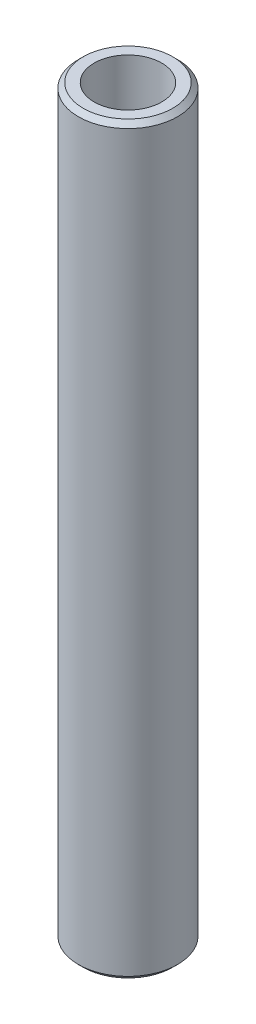
ISO-10303-21;
HEADER;
FILE_DESCRIPTION(('STEP AP214'),'2;1');
FILE_NAME('part.step','',(''),(''),'','','');
FILE_SCHEMA(('AUTOMOTIVE_DESIGN { 1 0 10303 214 1 1 1 1 }'));
ENDSEC;
DATA;
#1=APPLICATION_CONTEXT('core data for automotive mechanical design processes');
#2=APPLICATION_PROTOCOL_DEFINITION('international standard','automotive_design',2000,#1);
#3=PRODUCT_CONTEXT('',#1,'mechanical');
#4=PRODUCT('Part','Part','',(#3));
#5=PRODUCT_RELATED_PRODUCT_CATEGORY('part','',(#4));
#6=PRODUCT_DEFINITION_FORMATION('','',#4);
#7=PRODUCT_DEFINITION_CONTEXT('part definition',#1,'design');
#8=PRODUCT_DEFINITION('design','',#6,#7);
#9=PRODUCT_DEFINITION_SHAPE('','',#8);
#10=(LENGTH_UNIT() NAMED_UNIT(*) SI_UNIT(.MILLI.,.METRE.));
#11=(NAMED_UNIT(*) PLANE_ANGLE_UNIT() SI_UNIT($,.RADIAN.));
#12=(NAMED_UNIT(*) SI_UNIT($,.STERADIAN.) SOLID_ANGLE_UNIT());
#13=UNCERTAINTY_MEASURE_WITH_UNIT(LENGTH_MEASURE(1.E-05),#10,'distance_accuracy_value','');
#14=(GEOMETRIC_REPRESENTATION_CONTEXT(3) GLOBAL_UNCERTAINTY_ASSIGNED_CONTEXT((#13)) GLOBAL_UNIT_ASSIGNED_CONTEXT((#10,
#11,#12)) REPRESENTATION_CONTEXT('',''));
#15=CARTESIAN_POINT('',(0.,0.,0.));
#16=DIRECTION('',(0.,0.,1.));
#17=DIRECTION('',(1.,0.,0.));
#18=AXIS2_PLACEMENT_3D('',#15,#16,#17);
#19=CARTESIAN_POINT('',(0.,600.,0.));
#20=DIRECTION('',(0.,-1.,0.));
#21=DIRECTION('',(0.,0.,-1.));
#22=AXIS2_PLACEMENT_3D('',#19,#20,#21);
#23=CYLINDRICAL_SURFACE('',#22,40.);
#24=CARTESIAN_POINT('',(0.,596.080037776223,0.));
#25=DIRECTION('',(0.,1.,0.));
#26=DIRECTION('',(0.,0.,1.));
#27=AXIS2_PLACEMENT_3D('',#24,#25,#26);
#28=CIRCLE('',#27,40.);
#29=CARTESIAN_POINT('',(0.,596.080037776223,40.));
#30=VERTEX_POINT('',#29);
#31=EDGE_CURVE('E50',#30,#30,#28,.F.);
#32=ORIENTED_EDGE('',*,*,#31,.T.);
#33=EDGE_LOOP('',(#32));
#34=FACE_BOUND('',#33,.T.);
#35=CARTESIAN_POINT('',(0.,3.91996222377733,0.));
#36=DIRECTION('',(0.,1.,0.));
#37=DIRECTION('',(0.,0.,1.));
#38=AXIS2_PLACEMENT_3D('',#35,#36,#37);
#39=CIRCLE('',#38,40.);
#40=CARTESIAN_POINT('',(0.,3.91996222377733,40.));
#41=VERTEX_POINT('',#40);
#42=EDGE_CURVE('E51',#41,#41,#39,.T.);
#43=ORIENTED_EDGE('',*,*,#42,.T.);
#44=EDGE_LOOP('',(#43));
#45=FACE_BOUND('',#44,.T.);
#46=ADVANCED_FACE('F39',(#34,#45),#23,.T.);
#47=CARTESIAN_POINT('',(0.,600.,0.));
#48=DIRECTION('',(0.,1.,0.));
#49=DIRECTION('',(0.,0.,1.));
#50=AXIS2_PLACEMENT_3D('',#47,#48,#49);
#51=PLANE('',#50);
#52=CARTESIAN_POINT('',(0.,600.,0.));
#53=DIRECTION('',(0.,1.,0.));
#54=DIRECTION('',(0.,0.,1.));
#55=AXIS2_PLACEMENT_3D('',#52,#53,#54);
#56=CIRCLE('',#55,36.0800377762225);
#57=CARTESIAN_POINT('',(0.,600.,36.0800377762225));
#58=VERTEX_POINT('',#57);
#59=EDGE_CURVE('E54',#58,#58,#56,.T.);
#60=ORIENTED_EDGE('',*,*,#59,.T.);
#61=EDGE_LOOP('',(#60));
#62=FACE_BOUND('',#61,.T.);
#63=CARTESIAN_POINT('',(0.,600.,0.));
#64=DIRECTION('',(0.,1.,0.));
#65=DIRECTION('',(0.,0.,1.));
#66=AXIS2_PLACEMENT_3D('',#63,#64,#65);
#67=CIRCLE('',#66,27.2507902668685);
#68=CARTESIAN_POINT('',(0.,600.,27.2507902668685));
#69=VERTEX_POINT('',#68);
#70=EDGE_CURVE('E58',#69,#69,#67,.T.);
#71=ORIENTED_EDGE('',*,*,#70,.F.);
#72=EDGE_LOOP('',(#71));
#73=FACE_BOUND('',#72,.T.);
#74=ADVANCED_FACE('F69',(#62,#73),#51,.T.);
#75=CARTESIAN_POINT('',(0.,0.,0.));
#76=DIRECTION('',(0.,1.,0.));
#77=DIRECTION('',(0.,0.,1.));
#78=AXIS2_PLACEMENT_3D('',#75,#76,#77);
#79=PLANE('',#78);
#80=CARTESIAN_POINT('',(0.,0.,0.));
#81=DIRECTION('',(0.,1.,0.));
#82=DIRECTION('',(0.,0.,1.));
#83=AXIS2_PLACEMENT_3D('',#80,#81,#82);
#84=CIRCLE('',#83,36.0800377762227);
#85=CARTESIAN_POINT('',(0.,0.,36.0800377762227));
#86=VERTEX_POINT('',#85);
#87=EDGE_CURVE('E10',#86,#86,#84,.F.);
#88=ORIENTED_EDGE('',*,*,#87,.T.);
#89=EDGE_LOOP('',(#88));
#90=FACE_BOUND('',#89,.T.);
#91=CARTESIAN_POINT('',(0.,0.,0.));
#92=DIRECTION('',(0.,1.,0.));
#93=DIRECTION('',(0.,0.,1.));
#94=AXIS2_PLACEMENT_3D('',#91,#92,#93);
#95=CIRCLE('',#94,27.2507902668685);
#96=CARTESIAN_POINT('',(0.,0.,27.2507902668685));
#97=VERTEX_POINT('',#96);
#98=EDGE_CURVE('E63',#97,#97,#95,.T.);
#99=ORIENTED_EDGE('',*,*,#98,.T.);
#100=EDGE_LOOP('',(#99));
#101=FACE_BOUND('',#100,.T.);
#102=ADVANCED_FACE('F75',(#90,#101),#79,.F.);
#103=CARTESIAN_POINT('',(0.,600.,0.));
#104=DIRECTION('',(0.,-1.,0.));
#105=DIRECTION('',(0.,0.,-1.));
#106=AXIS2_PLACEMENT_3D('',#103,#104,#105);
#107=CYLINDRICAL_SURFACE('',#106,27.2507902668685);
#108=ORIENTED_EDGE('',*,*,#70,.T.);
#109=EDGE_LOOP('',(#108));
#110=FACE_BOUND('',#109,.T.);
#111=ORIENTED_EDGE('',*,*,#98,.F.);
#112=EDGE_LOOP('',(#111));
#113=FACE_BOUND('',#112,.T.);
#114=ADVANCED_FACE('F70',(#110,#113),#107,.F.);
#115=CARTESIAN_POINT('',(0.,600.,0.));
#116=DIRECTION('',(0.,-1.,0.));
#117=DIRECTION('',(0.,0.,-1.));
#118=AXIS2_PLACEMENT_3D('',#115,#116,#117);
#119=CONICAL_SURFACE('',#118,36.0800377762225,0.785398163397451);
#120=ORIENTED_EDGE('',*,*,#31,.F.);
#121=EDGE_LOOP('',(#120));
#122=FACE_BOUND('',#121,.T.);
#123=ORIENTED_EDGE('',*,*,#59,.F.);
#124=EDGE_LOOP('',(#123));
#125=FACE_BOUND('',#124,.T.);
#126=ADVANCED_FACE('F81',(#122,#125),#119,.T.);
#127=CARTESIAN_POINT('',(0.,3.91996222377733,0.));
#128=DIRECTION('',(0.,1.,0.));
#129=DIRECTION('',(0.,0.,1.));
#130=AXIS2_PLACEMENT_3D('',#127,#128,#129);
#131=CONICAL_SURFACE('',#130,40.,0.785398163397451);
#132=ORIENTED_EDGE('',*,*,#87,.F.);
#133=EDGE_LOOP('',(#132));
#134=FACE_BOUND('',#133,.T.);
#135=ORIENTED_EDGE('',*,*,#42,.F.);
#136=EDGE_LOOP('',(#135));
#137=FACE_BOUND('',#136,.T.);
#138=ADVANCED_FACE('F45',(#134,#137),#131,.T.);
#139=CLOSED_SHELL('',(#46,#74,#102,#114,#126,#138));
#140=MANIFOLD_SOLID_BREP('B2',#139);
#141=ADVANCED_BREP_SHAPE_REPRESENTATION('',(#18,#140),#14);
#142=SHAPE_DEFINITION_REPRESENTATION(#9,#141);
ENDSEC;
END-ISO-10303-21;
